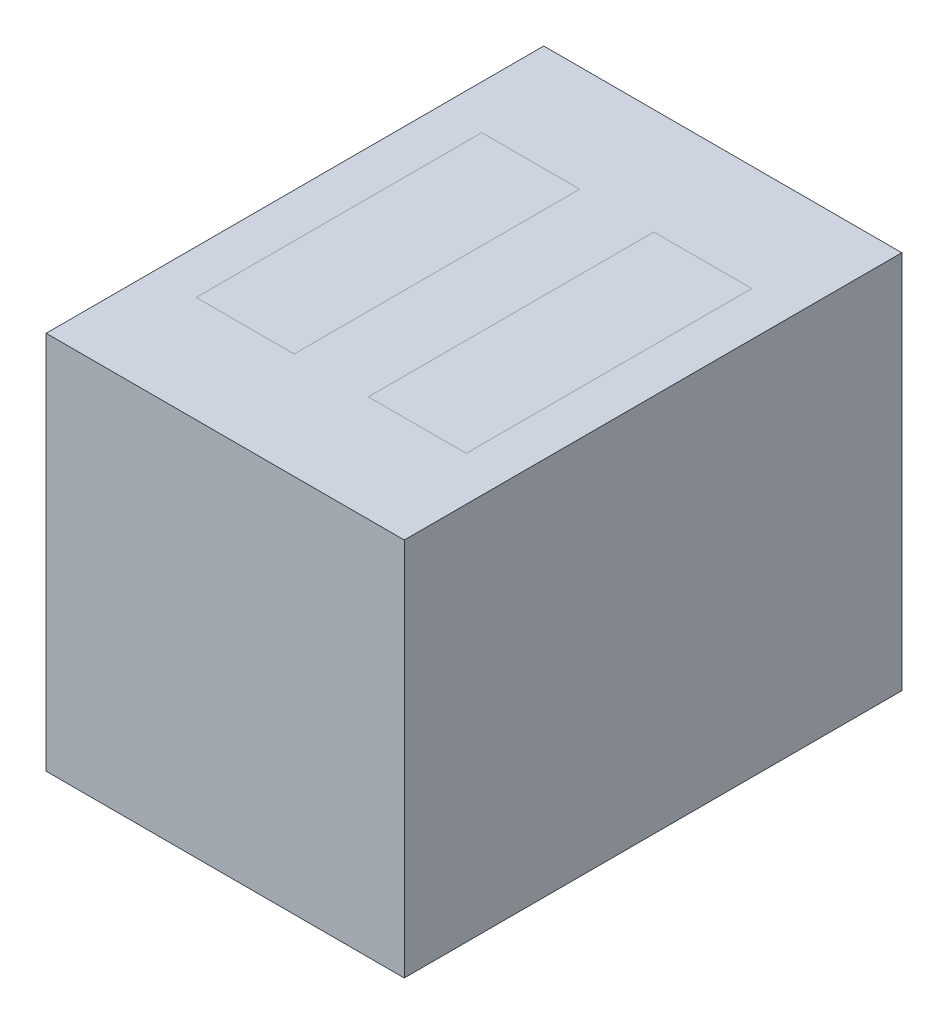
ISO-10303-21;
HEADER;
FILE_DESCRIPTION(('STEP AP214'),'2;1');
FILE_NAME('part.step','',(''),(''),'','','');
FILE_SCHEMA(('AUTOMOTIVE_DESIGN { 1 0 10303 214 1 1 1 1 }'));
ENDSEC;
DATA;
#1=APPLICATION_CONTEXT('core data for automotive mechanical design processes');
#2=APPLICATION_PROTOCOL_DEFINITION('international standard','automotive_design',2000,#1);
#3=PRODUCT_CONTEXT('',#1,'mechanical');
#4=PRODUCT('Part','Part','',(#3));
#5=PRODUCT_RELATED_PRODUCT_CATEGORY('part','',(#4));
#6=PRODUCT_DEFINITION_FORMATION('','',#4);
#7=PRODUCT_DEFINITION_CONTEXT('part definition',#1,'design');
#8=PRODUCT_DEFINITION('design','',#6,#7);
#9=PRODUCT_DEFINITION_SHAPE('','',#8);
#10=(LENGTH_UNIT() NAMED_UNIT(*) SI_UNIT(.MILLI.,.METRE.));
#11=(NAMED_UNIT(*) PLANE_ANGLE_UNIT() SI_UNIT($,.RADIAN.));
#12=(NAMED_UNIT(*) SI_UNIT($,.STERADIAN.) SOLID_ANGLE_UNIT());
#13=UNCERTAINTY_MEASURE_WITH_UNIT(LENGTH_MEASURE(1.E-05),#10,'distance_accuracy_value','');
#14=(GEOMETRIC_REPRESENTATION_CONTEXT(3) GLOBAL_UNCERTAINTY_ASSIGNED_CONTEXT((#13)) GLOBAL_UNIT_ASSIGNED_CONTEXT((#10,
#11,#12)) REPRESENTATION_CONTEXT('',''));
#15=CARTESIAN_POINT('',(0.,0.,0.));
#16=DIRECTION('',(0.,0.,1.));
#17=DIRECTION('',(1.,0.,0.));
#18=AXIS2_PLACEMENT_3D('',#15,#16,#17);
#19=CARTESIAN_POINT('',(3.85,-1.05,-4.8));
#20=DIRECTION('',(0.,0.,-1.));
#21=DIRECTION('',(-1.,0.,0.));
#22=AXIS2_PLACEMENT_3D('',#19,#20,#21);
#23=PLANE('',#22);
#24=DIRECTION('',(1.,0.,0.));
#25=VECTOR('',#24,1.);
#26=CARTESIAN_POINT('',(3.85,2.65,-4.8));
#27=LINE('',#26,#25);
#28=CARTESIAN_POINT('',(2.65,2.65,-4.8));
#29=VERTEX_POINT('',#28);
#30=CARTESIAN_POINT('',(3.85,2.65,-4.8));
#31=VERTEX_POINT('',#30);
#32=EDGE_CURVE('E56',#29,#31,#27,.T.);
#33=ORIENTED_EDGE('',*,*,#32,.F.);
#34=DIRECTION('',(0.,1.,0.));
#35=VECTOR('',#34,1.);
#36=CARTESIAN_POINT('',(2.65,-1.05,-4.8));
#37=LINE('',#36,#35);
#38=CARTESIAN_POINT('',(2.65,4.65,-4.8));
#39=VERTEX_POINT('',#38);
#40=EDGE_CURVE('E82',#29,#39,#37,.T.);
#41=ORIENTED_EDGE('',*,*,#40,.T.);
#42=DIRECTION('',(-1.,0.,0.));
#43=VECTOR('',#42,1.);
#44=CARTESIAN_POINT('',(3.85,4.65,-4.8));
#45=LINE('',#44,#43);
#46=CARTESIAN_POINT('',(3.85,4.65,-4.8));
#47=VERTEX_POINT('',#46);
#48=EDGE_CURVE('E86',#47,#39,#45,.T.);
#49=ORIENTED_EDGE('',*,*,#48,.F.);
#50=DIRECTION('',(0.,1.,0.));
#51=VECTOR('',#50,1.);
#52=CARTESIAN_POINT('',(3.85,-1.05,-4.8));
#53=LINE('',#52,#51);
#54=EDGE_CURVE('E108',#31,#47,#53,.T.);
#55=ORIENTED_EDGE('',*,*,#54,.F.);
#56=EDGE_LOOP('',(#33,#41,#49,#55));
#57=FACE_BOUND('',#56,.T.);
#58=ADVANCED_FACE('F48',(#57),#23,.T.);
#59=CARTESIAN_POINT('',(3.85,-1.05,-4.8));
#60=DIRECTION('',(1.,0.,0.));
#61=DIRECTION('',(0.,0.,-1.));
#62=AXIS2_PLACEMENT_3D('',#59,#60,#61);
#63=PLANE('',#62);
#64=DIRECTION('',(0.,0.,1.));
#65=VECTOR('',#64,1.);
#66=CARTESIAN_POINT('',(3.85,2.65,-4.8));
#67=LINE('',#66,#65);
#68=CARTESIAN_POINT('',(3.85,2.65,-1.3));
#69=VERTEX_POINT('',#68);
#70=EDGE_CURVE('E120',#31,#69,#67,.T.);
#71=ORIENTED_EDGE('',*,*,#70,.F.);
#72=ORIENTED_EDGE('',*,*,#54,.T.);
#73=DIRECTION('',(0.,0.,-1.));
#74=VECTOR('',#73,1.);
#75=CARTESIAN_POINT('',(3.85,4.65,-4.8));
#76=LINE('',#75,#74);
#77=CARTESIAN_POINT('',(3.85,4.65,-1.3));
#78=VERTEX_POINT('',#77);
#79=EDGE_CURVE('E90',#78,#47,#76,.T.);
#80=ORIENTED_EDGE('',*,*,#79,.F.);
#81=DIRECTION('',(0.,1.,0.));
#82=VECTOR('',#81,1.);
#83=CARTESIAN_POINT('',(3.85,-1.05,-1.3));
#84=LINE('',#83,#82);
#85=EDGE_CURVE('E111',#69,#78,#84,.T.);
#86=ORIENTED_EDGE('',*,*,#85,.F.);
#87=EDGE_LOOP('',(#71,#72,#80,#86));
#88=FACE_BOUND('',#87,.T.);
#89=ADVANCED_FACE('F119',(#88),#63,.T.);
#90=CARTESIAN_POINT('',(3.85,-1.05,-1.3));
#91=DIRECTION('',(0.,0.,1.));
#92=DIRECTION('',(1.,0.,0.));
#93=AXIS2_PLACEMENT_3D('',#90,#91,#92);
#94=PLANE('',#93);
#95=DIRECTION('',(-1.,0.,0.));
#96=VECTOR('',#95,1.);
#97=CARTESIAN_POINT('',(3.85,2.65,-1.3));
#98=LINE('',#97,#96);
#99=CARTESIAN_POINT('',(2.65,2.65,-1.3));
#100=VERTEX_POINT('',#99);
#101=EDGE_CURVE('E110',#69,#100,#98,.T.);
#102=ORIENTED_EDGE('',*,*,#101,.F.);
#103=ORIENTED_EDGE('',*,*,#85,.T.);
#104=DIRECTION('',(1.,0.,0.));
#105=VECTOR('',#104,1.);
#106=CARTESIAN_POINT('',(3.85,4.65,-1.3));
#107=LINE('',#106,#105);
#108=CARTESIAN_POINT('',(2.65,4.65,-1.3));
#109=VERTEX_POINT('',#108);
#110=EDGE_CURVE('E98',#109,#78,#107,.T.);
#111=ORIENTED_EDGE('',*,*,#110,.F.);
#112=DIRECTION('',(0.,1.,0.));
#113=VECTOR('',#112,1.);
#114=CARTESIAN_POINT('',(2.65,-1.05,-1.3));
#115=LINE('',#114,#113);
#116=EDGE_CURVE('E89',#100,#109,#115,.T.);
#117=ORIENTED_EDGE('',*,*,#116,.F.);
#118=EDGE_LOOP('',(#102,#103,#111,#117));
#119=FACE_BOUND('',#118,.T.);
#120=ADVANCED_FACE('F116',(#119),#94,.T.);
#121=CARTESIAN_POINT('',(2.65,-1.05,-4.8));
#122=DIRECTION('',(-1.,0.,0.));
#123=DIRECTION('',(0.,0.,1.));
#124=AXIS2_PLACEMENT_3D('',#121,#122,#123);
#125=PLANE('',#124);
#126=DIRECTION('',(0.,0.,-1.));
#127=VECTOR('',#126,1.);
#128=CARTESIAN_POINT('',(2.65,2.65,-4.8));
#129=LINE('',#128,#127);
#130=EDGE_CURVE('E12',#100,#29,#129,.T.);
#131=ORIENTED_EDGE('',*,*,#130,.F.);
#132=ORIENTED_EDGE('',*,*,#116,.T.);
#133=DIRECTION('',(0.,0.,1.));
#134=VECTOR('',#133,1.);
#135=CARTESIAN_POINT('',(2.65,4.65,-4.8));
#136=LINE('',#135,#134);
#137=EDGE_CURVE('E92',#39,#109,#136,.T.);
#138=ORIENTED_EDGE('',*,*,#137,.F.);
#139=ORIENTED_EDGE('',*,*,#40,.F.);
#140=EDGE_LOOP('',(#131,#132,#138,#139));
#141=FACE_BOUND('',#140,.T.);
#142=ADVANCED_FACE('F93',(#141),#125,.T.);
#143=CARTESIAN_POINT('',(0.,4.65,0.));
#144=DIRECTION('',(0.,1.,0.));
#145=DIRECTION('',(0.,0.,1.));
#146=AXIS2_PLACEMENT_3D('',#143,#144,#145);
#147=PLANE('',#146);
#148=ORIENTED_EDGE('',*,*,#48,.T.);
#149=ORIENTED_EDGE('',*,*,#137,.T.);
#150=ORIENTED_EDGE('',*,*,#110,.T.);
#151=ORIENTED_EDGE('',*,*,#79,.T.);
#152=EDGE_LOOP('',(#148,#149,#150,#151));
#153=FACE_BOUND('',#152,.T.);
#154=ADVANCED_FACE('F100',(#153),#147,.T.);
#155=CARTESIAN_POINT('',(0.,2.65,0.));
#156=DIRECTION('',(0.,1.,0.));
#157=DIRECTION('',(0.,0.,1.));
#158=AXIS2_PLACEMENT_3D('',#155,#156,#157);
#159=PLANE('',#158);
#160=ORIENTED_EDGE('',*,*,#32,.T.);
#161=ORIENTED_EDGE('',*,*,#70,.T.);
#162=ORIENTED_EDGE('',*,*,#101,.T.);
#163=ORIENTED_EDGE('',*,*,#130,.T.);
#164=EDGE_LOOP('',(#160,#161,#162,#163));
#165=FACE_BOUND('',#164,.T.);
#166=ADVANCED_FACE('F121',(#165),#159,.F.);
#167=CLOSED_SHELL('',(#58,#89,#120,#142,#154,#166));
#168=MANIFOLD_SOLID_BREP('B2',#167);
#169=CARTESIAN_POINT('',(0.539999999999999,-1.05,-4.8));
#170=DIRECTION('',(-1.,0.,0.));
#171=DIRECTION('',(0.,0.,1.));
#172=AXIS2_PLACEMENT_3D('',#169,#170,#171);
#173=PLANE('',#172);
#174=DIRECTION('',(0.,0.,-1.));
#175=VECTOR('',#174,1.);
#176=CARTESIAN_POINT('',(0.539999999999999,2.65,-4.8));
#177=LINE('',#176,#175);
#178=CARTESIAN_POINT('',(0.539999999999999,2.65,-1.3));
#179=VERTEX_POINT('',#178);
#180=CARTESIAN_POINT('',(0.539999999999999,2.65,-4.8));
#181=VERTEX_POINT('',#180);
#182=EDGE_CURVE('E189',#179,#181,#177,.T.);
#183=ORIENTED_EDGE('',*,*,#182,.F.);
#184=DIRECTION('',(0.,1.,0.));
#185=VECTOR('',#184,1.);
#186=CARTESIAN_POINT('',(0.539999999999999,-1.05,-1.3));
#187=LINE('',#186,#185);
#188=CARTESIAN_POINT('',(0.539999999999999,4.65,-1.3));
#189=VERTEX_POINT('',#188);
#190=EDGE_CURVE('E215',#179,#189,#187,.T.);
#191=ORIENTED_EDGE('',*,*,#190,.T.);
#192=DIRECTION('',(0.,0.,1.));
#193=VECTOR('',#192,1.);
#194=CARTESIAN_POINT('',(0.539999999999999,4.65,-4.8));
#195=LINE('',#194,#193);
#196=CARTESIAN_POINT('',(0.539999999999999,4.65,-4.8));
#197=VERTEX_POINT('',#196);
#198=EDGE_CURVE('E219',#197,#189,#195,.T.);
#199=ORIENTED_EDGE('',*,*,#198,.F.);
#200=DIRECTION('',(0.,1.,0.));
#201=VECTOR('',#200,1.);
#202=CARTESIAN_POINT('',(0.539999999999999,-1.05,-4.8));
#203=LINE('',#202,#201);
#204=EDGE_CURVE('E241',#181,#197,#203,.T.);
#205=ORIENTED_EDGE('',*,*,#204,.F.);
#206=EDGE_LOOP('',(#183,#191,#199,#205));
#207=FACE_BOUND('',#206,.T.);
#208=ADVANCED_FACE('F181',(#207),#173,.T.);
#209=CARTESIAN_POINT('',(0.539999999999999,-1.05,-4.8));
#210=DIRECTION('',(0.,0.,-1.));
#211=DIRECTION('',(-1.,0.,0.));
#212=AXIS2_PLACEMENT_3D('',#209,#210,#211);
#213=PLANE('',#212);
#214=DIRECTION('',(1.,0.,0.));
#215=VECTOR('',#214,1.);
#216=CARTESIAN_POINT('',(0.539999999999999,2.65,-4.8));
#217=LINE('',#216,#215);
#218=CARTESIAN_POINT('',(1.74,2.65,-4.8));
#219=VERTEX_POINT('',#218);
#220=EDGE_CURVE('E253',#181,#219,#217,.T.);
#221=ORIENTED_EDGE('',*,*,#220,.F.);
#222=ORIENTED_EDGE('',*,*,#204,.T.);
#223=DIRECTION('',(-1.,0.,0.));
#224=VECTOR('',#223,1.);
#225=CARTESIAN_POINT('',(0.539999999999999,4.65,-4.8));
#226=LINE('',#225,#224);
#227=CARTESIAN_POINT('',(1.74,4.65,-4.8));
#228=VERTEX_POINT('',#227);
#229=EDGE_CURVE('E223',#228,#197,#226,.T.);
#230=ORIENTED_EDGE('',*,*,#229,.F.);
#231=DIRECTION('',(0.,1.,0.));
#232=VECTOR('',#231,1.);
#233=CARTESIAN_POINT('',(1.74,-1.05,-4.8));
#234=LINE('',#233,#232);
#235=EDGE_CURVE('E244',#219,#228,#234,.T.);
#236=ORIENTED_EDGE('',*,*,#235,.F.);
#237=EDGE_LOOP('',(#221,#222,#230,#236));
#238=FACE_BOUND('',#237,.T.);
#239=ADVANCED_FACE('F252',(#238),#213,.T.);
#240=CARTESIAN_POINT('',(1.74,-1.05,-4.8));
#241=DIRECTION('',(1.,0.,0.));
#242=DIRECTION('',(0.,0.,-1.));
#243=AXIS2_PLACEMENT_3D('',#240,#241,#242);
#244=PLANE('',#243);
#245=DIRECTION('',(0.,0.,1.));
#246=VECTOR('',#245,1.);
#247=CARTESIAN_POINT('',(1.74,2.65,-4.8));
#248=LINE('',#247,#246);
#249=CARTESIAN_POINT('',(1.74,2.65,-1.3));
#250=VERTEX_POINT('',#249);
#251=EDGE_CURVE('E243',#219,#250,#248,.T.);
#252=ORIENTED_EDGE('',*,*,#251,.F.);
#253=ORIENTED_EDGE('',*,*,#235,.T.);
#254=DIRECTION('',(0.,0.,-1.));
#255=VECTOR('',#254,1.);
#256=CARTESIAN_POINT('',(1.74,4.65,-4.8));
#257=LINE('',#256,#255);
#258=CARTESIAN_POINT('',(1.74,4.65,-1.3));
#259=VERTEX_POINT('',#258);
#260=EDGE_CURVE('E231',#259,#228,#257,.T.);
#261=ORIENTED_EDGE('',*,*,#260,.F.);
#262=DIRECTION('',(0.,1.,0.));
#263=VECTOR('',#262,1.);
#264=CARTESIAN_POINT('',(1.74,-1.05,-1.3));
#265=LINE('',#264,#263);
#266=EDGE_CURVE('E222',#250,#259,#265,.T.);
#267=ORIENTED_EDGE('',*,*,#266,.F.);
#268=EDGE_LOOP('',(#252,#253,#261,#267));
#269=FACE_BOUND('',#268,.T.);
#270=ADVANCED_FACE('F249',(#269),#244,.T.);
#271=CARTESIAN_POINT('',(0.539999999999999,-1.05,-1.3));
#272=DIRECTION('',(0.,0.,1.));
#273=DIRECTION('',(1.,0.,0.));
#274=AXIS2_PLACEMENT_3D('',#271,#272,#273);
#275=PLANE('',#274);
#276=DIRECTION('',(-1.,0.,0.));
#277=VECTOR('',#276,1.);
#278=CARTESIAN_POINT('',(0.539999999999999,2.65,-1.3));
#279=LINE('',#278,#277);
#280=EDGE_CURVE('E46',#250,#179,#279,.T.);
#281=ORIENTED_EDGE('',*,*,#280,.F.);
#282=ORIENTED_EDGE('',*,*,#266,.T.);
#283=DIRECTION('',(1.,0.,0.));
#284=VECTOR('',#283,1.);
#285=CARTESIAN_POINT('',(0.539999999999999,4.65,-1.3));
#286=LINE('',#285,#284);
#287=EDGE_CURVE('E225',#189,#259,#286,.T.);
#288=ORIENTED_EDGE('',*,*,#287,.F.);
#289=ORIENTED_EDGE('',*,*,#190,.F.);
#290=EDGE_LOOP('',(#281,#282,#288,#289));
#291=FACE_BOUND('',#290,.T.);
#292=ADVANCED_FACE('F226',(#291),#275,.T.);
#293=CARTESIAN_POINT('',(0.,4.65,0.));
#294=DIRECTION('',(0.,1.,0.));
#295=DIRECTION('',(0.,0.,1.));
#296=AXIS2_PLACEMENT_3D('',#293,#294,#295);
#297=PLANE('',#296);
#298=ORIENTED_EDGE('',*,*,#198,.T.);
#299=ORIENTED_EDGE('',*,*,#287,.T.);
#300=ORIENTED_EDGE('',*,*,#260,.T.);
#301=ORIENTED_EDGE('',*,*,#229,.T.);
#302=EDGE_LOOP('',(#298,#299,#300,#301));
#303=FACE_BOUND('',#302,.T.);
#304=ADVANCED_FACE('F233',(#303),#297,.T.);
#305=CARTESIAN_POINT('',(0.,2.65,0.));
#306=DIRECTION('',(0.,1.,0.));
#307=DIRECTION('',(0.,0.,1.));
#308=AXIS2_PLACEMENT_3D('',#305,#306,#307);
#309=PLANE('',#308);
#310=ORIENTED_EDGE('',*,*,#182,.T.);
#311=ORIENTED_EDGE('',*,*,#220,.T.);
#312=ORIENTED_EDGE('',*,*,#251,.T.);
#313=ORIENTED_EDGE('',*,*,#280,.T.);
#314=EDGE_LOOP('',(#310,#311,#312,#313));
#315=FACE_BOUND('',#314,.T.);
#316=ADVANCED_FACE('F254',(#315),#309,.F.);
#317=CLOSED_SHELL('',(#208,#239,#270,#292,#304,#316));
#318=MANIFOLD_SOLID_BREP('B6',#317);
#319=CARTESIAN_POINT('',(0.,4.65,0.));
#320=DIRECTION('',(1.,0.,0.));
#321=DIRECTION('',(0.,0.,-1.));
#322=AXIS2_PLACEMENT_3D('',#319,#320,#321);
#323=PLANE('',#322);
#324=DIRECTION('',(0.,0.,1.));
#325=VECTOR('',#324,1.);
#326=CARTESIAN_POINT('',(0.,0.,0.));
#327=LINE('',#326,#325);
#328=CARTESIAN_POINT('',(0.,0.,-6.1));
#329=VERTEX_POINT('',#328);
#330=CARTESIAN_POINT('',(0.,0.,0.));
#331=VERTEX_POINT('',#330);
#332=EDGE_CURVE('E456',#329,#331,#327,.T.);
#333=ORIENTED_EDGE('',*,*,#332,.T.);
#334=DIRECTION('',(0.,-1.,0.));
#335=VECTOR('',#334,1.);
#336=CARTESIAN_POINT('',(0.,4.65,0.));
#337=LINE('',#336,#335);
#338=CARTESIAN_POINT('',(0.,4.65,0.));
#339=VERTEX_POINT('',#338);
#340=EDGE_CURVE('E179',#339,#331,#337,.T.);
#341=ORIENTED_EDGE('',*,*,#340,.F.);
#342=DIRECTION('',(0.,0.,1.));
#343=VECTOR('',#342,1.);
#344=CARTESIAN_POINT('',(0.,4.65,0.));
#345=LINE('',#344,#343);
#346=CARTESIAN_POINT('',(0.,4.65,-6.1));
#347=VERTEX_POINT('',#346);
#348=EDGE_CURVE('E462',#347,#339,#345,.T.);
#349=ORIENTED_EDGE('',*,*,#348,.F.);
#350=DIRECTION('',(0.,-1.,0.));
#351=VECTOR('',#350,1.);
#352=CARTESIAN_POINT('',(0.,4.65,-6.1));
#353=LINE('',#352,#351);
#354=EDGE_CURVE('E472',#347,#329,#353,.T.);
#355=ORIENTED_EDGE('',*,*,#354,.T.);
#356=EDGE_LOOP('',(#333,#341,#349,#355));
#357=FACE_BOUND('',#356,.T.);
#358=ADVANCED_FACE('F305',(#357),#323,.F.);
#359=CARTESIAN_POINT('',(0.,4.65,0.));
#360=DIRECTION('',(0.,0.,-1.));
#361=DIRECTION('',(-1.,0.,0.));
#362=AXIS2_PLACEMENT_3D('',#359,#360,#361);
#363=PLANE('',#362);
#364=DIRECTION('',(1.,0.,0.));
#365=VECTOR('',#364,1.);
#366=CARTESIAN_POINT('',(0.,0.,0.));
#367=LINE('',#366,#365);
#368=CARTESIAN_POINT('',(4.39,0.,0.));
#369=VERTEX_POINT('',#368);
#370=EDGE_CURVE('E475',#331,#369,#367,.T.);
#371=ORIENTED_EDGE('',*,*,#370,.T.);
#372=DIRECTION('',(0.,-1.,0.));
#373=VECTOR('',#372,1.);
#374=CARTESIAN_POINT('',(4.39,4.65,0.));
#375=LINE('',#374,#373);
#376=CARTESIAN_POINT('',(4.39,4.65,0.));
#377=VERTEX_POINT('',#376);
#378=EDGE_CURVE('E312',#377,#369,#375,.T.);
#379=ORIENTED_EDGE('',*,*,#378,.F.);
#380=DIRECTION('',(1.,0.,0.));
#381=VECTOR('',#380,1.);
#382=CARTESIAN_POINT('',(0.,4.65,0.));
#383=LINE('',#382,#381);
#384=EDGE_CURVE('E465',#339,#377,#383,.T.);
#385=ORIENTED_EDGE('',*,*,#384,.F.);
#386=ORIENTED_EDGE('',*,*,#340,.T.);
#387=EDGE_LOOP('',(#371,#379,#385,#386));
#388=FACE_BOUND('',#387,.T.);
#389=ADVANCED_FACE('F505',(#388),#363,.F.);
#390=CARTESIAN_POINT('',(4.39,4.65,0.));
#391=DIRECTION('',(-1.,0.,0.));
#392=DIRECTION('',(0.,0.,1.));
#393=AXIS2_PLACEMENT_3D('',#390,#391,#392);
#394=PLANE('',#393);
#395=DIRECTION('',(0.,0.,-1.));
#396=VECTOR('',#395,1.);
#397=CARTESIAN_POINT('',(4.39,0.,0.));
#398=LINE('',#397,#396);
#399=CARTESIAN_POINT('',(4.39,0.,-6.1));
#400=VERTEX_POINT('',#399);
#401=EDGE_CURVE('E477',#369,#400,#398,.T.);
#402=ORIENTED_EDGE('',*,*,#401,.T.);
#403=DIRECTION('',(0.,-1.,0.));
#404=VECTOR('',#403,1.);
#405=CARTESIAN_POINT('',(4.39,4.65,-6.1));
#406=LINE('',#405,#404);
#407=CARTESIAN_POINT('',(4.39,4.65,-6.1));
#408=VERTEX_POINT('',#407);
#409=EDGE_CURVE('E482',#408,#400,#406,.T.);
#410=ORIENTED_EDGE('',*,*,#409,.F.);
#411=DIRECTION('',(0.,0.,-1.));
#412=VECTOR('',#411,1.);
#413=CARTESIAN_POINT('',(4.39,4.65,0.));
#414=LINE('',#413,#412);
#415=EDGE_CURVE('E468',#377,#408,#414,.T.);
#416=ORIENTED_EDGE('',*,*,#415,.F.);
#417=ORIENTED_EDGE('',*,*,#378,.T.);
#418=EDGE_LOOP('',(#402,#410,#416,#417));
#419=FACE_BOUND('',#418,.T.);
#420=ADVANCED_FACE('F489',(#419),#394,.F.);
#421=CARTESIAN_POINT('',(0.,4.65,-6.1));
#422=DIRECTION('',(0.,0.,1.));
#423=DIRECTION('',(1.,0.,0.));
#424=AXIS2_PLACEMENT_3D('',#421,#422,#423);
#425=PLANE('',#424);
#426=DIRECTION('',(-1.,0.,0.));
#427=VECTOR('',#426,1.);
#428=CARTESIAN_POINT('',(0.,0.,-6.1));
#429=LINE('',#428,#427);
#430=EDGE_CURVE('E466',#400,#329,#429,.T.);
#431=ORIENTED_EDGE('',*,*,#430,.T.);
#432=ORIENTED_EDGE('',*,*,#354,.F.);
#433=DIRECTION('',(-1.,0.,0.));
#434=VECTOR('',#433,1.);
#435=CARTESIAN_POINT('',(0.,4.65,-6.1));
#436=LINE('',#435,#434);
#437=EDGE_CURVE('E470',#408,#347,#436,.T.);
#438=ORIENTED_EDGE('',*,*,#437,.F.);
#439=ORIENTED_EDGE('',*,*,#409,.T.);
#440=EDGE_LOOP('',(#431,#432,#438,#439));
#441=FACE_BOUND('',#440,.T.);
#442=ADVANCED_FACE('F498',(#441),#425,.F.);
#443=CARTESIAN_POINT('',(0.,4.65,0.));
#444=DIRECTION('',(0.,-1.,0.));
#445=DIRECTION('',(0.,0.,-1.));
#446=AXIS2_PLACEMENT_3D('',#443,#444,#445);
#447=PLANE('',#446);
#448=DIRECTION('',(0.,0.,1.));
#449=VECTOR('',#448,1.);
#450=CARTESIAN_POINT('',(2.65,4.65,-4.8));
#451=LINE('',#450,#449);
#452=CARTESIAN_POINT('',(2.65,4.65,-4.8));
#453=VERTEX_POINT('',#452);
#454=CARTESIAN_POINT('',(2.65,4.65,-1.3));
#455=VERTEX_POINT('',#454);
#456=EDGE_CURVE('E422',#453,#455,#451,.T.);
#457=ORIENTED_EDGE('',*,*,#456,.F.);
#458=DIRECTION('',(-1.,0.,0.));
#459=VECTOR('',#458,1.);
#460=CARTESIAN_POINT('',(3.85,4.65,-4.8));
#461=LINE('',#460,#459);
#462=CARTESIAN_POINT('',(3.85,4.65,-4.8));
#463=VERTEX_POINT('',#462);
#464=EDGE_CURVE('E319',#463,#453,#461,.T.);
#465=ORIENTED_EDGE('',*,*,#464,.F.);
#466=DIRECTION('',(0.,0.,-1.));
#467=VECTOR('',#466,1.);
#468=CARTESIAN_POINT('',(3.85,4.65,-4.8));
#469=LINE('',#468,#467);
#470=CARTESIAN_POINT('',(3.85,4.65,-1.3));
#471=VERTEX_POINT('',#470);
#472=EDGE_CURVE('E413',#471,#463,#469,.T.);
#473=ORIENTED_EDGE('',*,*,#472,.F.);
#474=DIRECTION('',(1.,0.,0.));
#475=VECTOR('',#474,1.);
#476=CARTESIAN_POINT('',(3.85,4.65,-1.3));
#477=LINE('',#476,#475);
#478=EDGE_CURVE('E416',#455,#471,#477,.T.);
#479=ORIENTED_EDGE('',*,*,#478,.F.);
#480=EDGE_LOOP('',(#457,#465,#473,#479));
#481=FACE_BOUND('',#480,.T.);
#482=DIRECTION('',(1.,0.,0.));
#483=VECTOR('',#482,1.);
#484=CARTESIAN_POINT('',(0.539999999999999,4.65,-1.3));
#485=LINE('',#484,#483);
#486=CARTESIAN_POINT('',(0.539999999999999,4.65,-1.3));
#487=VERTEX_POINT('',#486);
#488=CARTESIAN_POINT('',(1.74,4.65,-1.3));
#489=VERTEX_POINT('',#488);
#490=EDGE_CURVE('E446',#487,#489,#485,.T.);
#491=ORIENTED_EDGE('',*,*,#490,.F.);
#492=DIRECTION('',(0.,0.,1.));
#493=VECTOR('',#492,1.);
#494=CARTESIAN_POINT('',(0.539999999999999,4.65,-4.8));
#495=LINE('',#494,#493);
#496=CARTESIAN_POINT('',(0.539999999999999,4.65,-4.8));
#497=VERTEX_POINT('',#496);
#498=EDGE_CURVE('E327',#497,#487,#495,.T.);
#499=ORIENTED_EDGE('',*,*,#498,.F.);
#500=DIRECTION('',(-1.,0.,0.));
#501=VECTOR('',#500,1.);
#502=CARTESIAN_POINT('',(0.539999999999999,4.65,-4.8));
#503=LINE('',#502,#501);
#504=CARTESIAN_POINT('',(1.74,4.65,-4.8));
#505=VERTEX_POINT('',#504);
#506=EDGE_CURVE('E435',#505,#497,#503,.T.);
#507=ORIENTED_EDGE('',*,*,#506,.F.);
#508=DIRECTION('',(0.,0.,-1.));
#509=VECTOR('',#508,1.);
#510=CARTESIAN_POINT('',(1.74,4.65,-4.8));
#511=LINE('',#510,#509);
#512=EDGE_CURVE('E449',#489,#505,#511,.T.);
#513=ORIENTED_EDGE('',*,*,#512,.F.);
#514=EDGE_LOOP('',(#491,#499,#507,#513));
#515=FACE_BOUND('',#514,.T.);
#516=ORIENTED_EDGE('',*,*,#348,.T.);
#517=ORIENTED_EDGE('',*,*,#384,.T.);
#518=ORIENTED_EDGE('',*,*,#415,.T.);
#519=ORIENTED_EDGE('',*,*,#437,.T.);
#520=EDGE_LOOP('',(#516,#517,#518,#519));
#521=FACE_BOUND('',#520,.T.);
#522=ADVANCED_FACE('F504',(#481,#515,#521),#447,.F.);
#523=CARTESIAN_POINT('',(0.,0.,0.));
#524=DIRECTION('',(0.,-1.,0.));
#525=DIRECTION('',(0.,0.,-1.));
#526=AXIS2_PLACEMENT_3D('',#523,#524,#525);
#527=PLANE('',#526);
#528=ORIENTED_EDGE('',*,*,#332,.F.);
#529=ORIENTED_EDGE('',*,*,#430,.F.);
#530=ORIENTED_EDGE('',*,*,#401,.F.);
#531=ORIENTED_EDGE('',*,*,#370,.F.);
#532=EDGE_LOOP('',(#528,#529,#530,#531));
#533=FACE_BOUND('',#532,.T.);
#534=ADVANCED_FACE('F495',(#533),#527,.T.);
#535=CARTESIAN_POINT('',(0.539999999999999,2.65,-4.8));
#536=DIRECTION('',(-1.,0.,0.));
#537=DIRECTION('',(0.,0.,1.));
#538=AXIS2_PLACEMENT_3D('',#535,#536,#537);
#539=PLANE('',#538);
#540=ORIENTED_EDGE('',*,*,#498,.T.);
#541=DIRECTION('',(0.,1.,0.));
#542=VECTOR('',#541,1.);
#543=CARTESIAN_POINT('',(0.539999999999999,2.65,-1.3));
#544=LINE('',#543,#542);
#545=CARTESIAN_POINT('',(0.539999999999999,2.65,-1.3));
#546=VERTEX_POINT('',#545);
#547=EDGE_CURVE('E444',#546,#487,#544,.T.);
#548=ORIENTED_EDGE('',*,*,#547,.F.);
#549=DIRECTION('',(0.,0.,1.));
#550=VECTOR('',#549,1.);
#551=CARTESIAN_POINT('',(0.539999999999999,2.65,-4.8));
#552=LINE('',#551,#550);
#553=CARTESIAN_POINT('',(0.539999999999999,2.65,-4.8));
#554=VERTEX_POINT('',#553);
#555=EDGE_CURVE('E431',#554,#546,#552,.T.);
#556=ORIENTED_EDGE('',*,*,#555,.F.);
#557=DIRECTION('',(0.,1.,0.));
#558=VECTOR('',#557,1.);
#559=CARTESIAN_POINT('',(0.539999999999999,2.65,-4.8));
#560=LINE('',#559,#558);
#561=EDGE_CURVE('E454',#554,#497,#560,.T.);
#562=ORIENTED_EDGE('',*,*,#561,.T.);
#563=EDGE_LOOP('',(#540,#548,#556,#562));
#564=FACE_BOUND('',#563,.T.);
#565=ADVANCED_FACE('F517',(#564),#539,.F.);
#566=CARTESIAN_POINT('',(0.539999999999999,2.65,-4.8));
#567=DIRECTION('',(0.,0.,-1.));
#568=DIRECTION('',(-1.,0.,0.));
#569=AXIS2_PLACEMENT_3D('',#566,#567,#568);
#570=PLANE('',#569);
#571=ORIENTED_EDGE('',*,*,#506,.T.);
#572=ORIENTED_EDGE('',*,*,#561,.F.);
#573=DIRECTION('',(-1.,0.,0.));
#574=VECTOR('',#573,1.);
#575=CARTESIAN_POINT('',(0.539999999999999,2.65,-4.8));
#576=LINE('',#575,#574);
#577=CARTESIAN_POINT('',(1.74,2.65,-4.8));
#578=VERTEX_POINT('',#577);
#579=EDGE_CURVE('E441',#578,#554,#576,.T.);
#580=ORIENTED_EDGE('',*,*,#579,.F.);
#581=DIRECTION('',(0.,1.,0.));
#582=VECTOR('',#581,1.);
#583=CARTESIAN_POINT('',(1.74,2.65,-4.8));
#584=LINE('',#583,#582);
#585=EDGE_CURVE('E457',#578,#505,#584,.T.);
#586=ORIENTED_EDGE('',*,*,#585,.T.);
#587=EDGE_LOOP('',(#571,#572,#580,#586));
#588=FACE_BOUND('',#587,.T.);
#589=ADVANCED_FACE('F523',(#588),#570,.F.);
#590=CARTESIAN_POINT('',(1.74,2.65,-4.8));
#591=DIRECTION('',(1.,0.,0.));
#592=DIRECTION('',(0.,0.,-1.));
#593=AXIS2_PLACEMENT_3D('',#590,#591,#592);
#594=PLANE('',#593);
#595=ORIENTED_EDGE('',*,*,#512,.T.);
#596=ORIENTED_EDGE('',*,*,#585,.F.);
#597=DIRECTION('',(0.,0.,-1.));
#598=VECTOR('',#597,1.);
#599=CARTESIAN_POINT('',(1.74,2.65,-4.8));
#600=LINE('',#599,#598);
#601=CARTESIAN_POINT('',(1.74,2.65,-1.3));
#602=VERTEX_POINT('',#601);
#603=EDGE_CURVE('E438',#602,#578,#600,.T.);
#604=ORIENTED_EDGE('',*,*,#603,.F.);
#605=DIRECTION('',(0.,1.,0.));
#606=VECTOR('',#605,1.);
#607=CARTESIAN_POINT('',(1.74,2.65,-1.3));
#608=LINE('',#607,#606);
#609=EDGE_CURVE('E459',#602,#489,#608,.T.);
#610=ORIENTED_EDGE('',*,*,#609,.T.);
#611=EDGE_LOOP('',(#595,#596,#604,#610));
#612=FACE_BOUND('',#611,.T.);
#613=ADVANCED_FACE('F528',(#612),#594,.F.);
#614=CARTESIAN_POINT('',(0.539999999999999,2.65,-1.3));
#615=DIRECTION('',(0.,0.,1.));
#616=DIRECTION('',(1.,0.,0.));
#617=AXIS2_PLACEMENT_3D('',#614,#615,#616);
#618=PLANE('',#617);
#619=ORIENTED_EDGE('',*,*,#490,.T.);
#620=ORIENTED_EDGE('',*,*,#609,.F.);
#621=DIRECTION('',(1.,0.,0.));
#622=VECTOR('',#621,1.);
#623=CARTESIAN_POINT('',(0.539999999999999,2.65,-1.3));
#624=LINE('',#623,#622);
#625=EDGE_CURVE('E434',#546,#602,#624,.T.);
#626=ORIENTED_EDGE('',*,*,#625,.F.);
#627=ORIENTED_EDGE('',*,*,#547,.T.);
#628=EDGE_LOOP('',(#619,#620,#626,#627));
#629=FACE_BOUND('',#628,.T.);
#630=ADVANCED_FACE('F524',(#629),#618,.F.);
#631=CARTESIAN_POINT('',(0.,2.65,0.));
#632=DIRECTION('',(0.,1.,0.));
#633=DIRECTION('',(0.,0.,1.));
#634=AXIS2_PLACEMENT_3D('',#631,#632,#633);
#635=PLANE('',#634);
#636=ORIENTED_EDGE('',*,*,#555,.T.);
#637=ORIENTED_EDGE('',*,*,#625,.T.);
#638=ORIENTED_EDGE('',*,*,#603,.T.);
#639=ORIENTED_EDGE('',*,*,#579,.T.);
#640=EDGE_LOOP('',(#636,#637,#638,#639));
#641=FACE_BOUND('',#640,.T.);
#642=ADVANCED_FACE('F527',(#641),#635,.T.);
#643=CARTESIAN_POINT('',(3.85,2.65,-4.8));
#644=DIRECTION('',(0.,0.,-1.));
#645=DIRECTION('',(-1.,0.,0.));
#646=AXIS2_PLACEMENT_3D('',#643,#644,#645);
#647=PLANE('',#646);
#648=ORIENTED_EDGE('',*,*,#464,.T.);
#649=DIRECTION('',(0.,1.,0.));
#650=VECTOR('',#649,1.);
#651=CARTESIAN_POINT('',(2.65,2.65,-4.8));
#652=LINE('',#651,#650);
#653=CARTESIAN_POINT('',(2.65,2.65,-4.8));
#654=VERTEX_POINT('',#653);
#655=EDGE_CURVE('E391',#654,#453,#652,.T.);
#656=ORIENTED_EDGE('',*,*,#655,.F.);
#657=DIRECTION('',(-1.,0.,0.));
#658=VECTOR('',#657,1.);
#659=CARTESIAN_POINT('',(3.85,2.65,-4.8));
#660=LINE('',#659,#658);
#661=CARTESIAN_POINT('',(3.85,2.65,-4.8));
#662=VERTEX_POINT('',#661);
#663=EDGE_CURVE('E395',#662,#654,#660,.T.);
#664=ORIENTED_EDGE('',*,*,#663,.F.);
#665=DIRECTION('',(0.,1.,0.));
#666=VECTOR('',#665,1.);
#667=CARTESIAN_POINT('',(3.85,2.65,-4.8));
#668=LINE('',#667,#666);
#669=EDGE_CURVE('E426',#662,#463,#668,.T.);
#670=ORIENTED_EDGE('',*,*,#669,.T.);
#671=EDGE_LOOP('',(#648,#656,#664,#670));
#672=FACE_BOUND('',#671,.T.);
#673=ADVANCED_FACE('F393',(#672),#647,.F.);
#674=CARTESIAN_POINT('',(3.85,2.65,-4.8));
#675=DIRECTION('',(1.,0.,0.));
#676=DIRECTION('',(0.,0.,-1.));
#677=AXIS2_PLACEMENT_3D('',#674,#675,#676);
#678=PLANE('',#677);
#679=ORIENTED_EDGE('',*,*,#472,.T.);
#680=ORIENTED_EDGE('',*,*,#669,.F.);
#681=DIRECTION('',(0.,0.,-1.));
#682=VECTOR('',#681,1.);
#683=CARTESIAN_POINT('',(3.85,2.65,-4.8));
#684=LINE('',#683,#682);
#685=CARTESIAN_POINT('',(3.85,2.65,-1.3));
#686=VERTEX_POINT('',#685);
#687=EDGE_CURVE('E401',#686,#662,#684,.T.);
#688=ORIENTED_EDGE('',*,*,#687,.F.);
#689=DIRECTION('',(0.,1.,0.));
#690=VECTOR('',#689,1.);
#691=CARTESIAN_POINT('',(3.85,2.65,-1.3));
#692=LINE('',#691,#690);
#693=EDGE_CURVE('E428',#686,#471,#692,.T.);
#694=ORIENTED_EDGE('',*,*,#693,.T.);
#695=EDGE_LOOP('',(#679,#680,#688,#694));
#696=FACE_BOUND('',#695,.T.);
#697=ADVANCED_FACE('F541',(#696),#678,.F.);
#698=CARTESIAN_POINT('',(3.85,2.65,-1.3));
#699=DIRECTION('',(0.,0.,1.));
#700=DIRECTION('',(1.,0.,0.));
#701=AXIS2_PLACEMENT_3D('',#698,#699,#700);
#702=PLANE('',#701);
#703=ORIENTED_EDGE('',*,*,#478,.T.);
#704=ORIENTED_EDGE('',*,*,#693,.F.);
#705=DIRECTION('',(1.,0.,0.));
#706=VECTOR('',#705,1.);
#707=CARTESIAN_POINT('',(3.85,2.65,-1.3));
#708=LINE('',#707,#706);
#709=CARTESIAN_POINT('',(2.65,2.65,-1.3));
#710=VERTEX_POINT('',#709);
#711=EDGE_CURVE('E409',#710,#686,#708,.T.);
#712=ORIENTED_EDGE('',*,*,#711,.F.);
#713=DIRECTION('',(0.,1.,0.));
#714=VECTOR('',#713,1.);
#715=CARTESIAN_POINT('',(2.65,2.65,-1.3));
#716=LINE('',#715,#714);
#717=EDGE_CURVE('E400',#710,#455,#716,.T.);
#718=ORIENTED_EDGE('',*,*,#717,.T.);
#719=EDGE_LOOP('',(#703,#704,#712,#718));
#720=FACE_BOUND('',#719,.T.);
#721=ADVANCED_FACE('F544',(#720),#702,.F.);
#722=CARTESIAN_POINT('',(2.65,2.65,-4.8));
#723=DIRECTION('',(-1.,0.,0.));
#724=DIRECTION('',(0.,0.,1.));
#725=AXIS2_PLACEMENT_3D('',#722,#723,#724);
#726=PLANE('',#725);
#727=ORIENTED_EDGE('',*,*,#456,.T.);
#728=ORIENTED_EDGE('',*,*,#717,.F.);
#729=DIRECTION('',(0.,0.,1.));
#730=VECTOR('',#729,1.);
#731=CARTESIAN_POINT('',(2.65,2.65,-4.8));
#732=LINE('',#731,#730);
#733=EDGE_CURVE('E404',#654,#710,#732,.T.);
#734=ORIENTED_EDGE('',*,*,#733,.F.);
#735=ORIENTED_EDGE('',*,*,#655,.T.);
#736=EDGE_LOOP('',(#727,#728,#734,#735));
#737=FACE_BOUND('',#736,.T.);
#738=ADVANCED_FACE('F405',(#737),#726,.F.);
#739=CARTESIAN_POINT('',(0.,2.65,0.));
#740=DIRECTION('',(0.,1.,0.));
#741=DIRECTION('',(0.,0.,1.));
#742=AXIS2_PLACEMENT_3D('',#739,#740,#741);
#743=PLANE('',#742);
#744=ORIENTED_EDGE('',*,*,#663,.T.);
#745=ORIENTED_EDGE('',*,*,#733,.T.);
#746=ORIENTED_EDGE('',*,*,#711,.T.);
#747=ORIENTED_EDGE('',*,*,#687,.T.);
#748=EDGE_LOOP('',(#744,#745,#746,#747));
#749=FACE_BOUND('',#748,.T.);
#750=ADVANCED_FACE('F411',(#749),#743,.T.);
#751=CLOSED_SHELL('',(#358,#389,#420,#442,#522,#534,#565,#589,#613,#630,#642,#673,#697,#721,
#738,#750));
#752=MANIFOLD_SOLID_BREP('B40',#751);
#753=ADVANCED_BREP_SHAPE_REPRESENTATION('',(#18,#168,#318,#752),#14);
#754=SHAPE_DEFINITION_REPRESENTATION(#9,#753);
ENDSEC;
END-ISO-10303-21;
